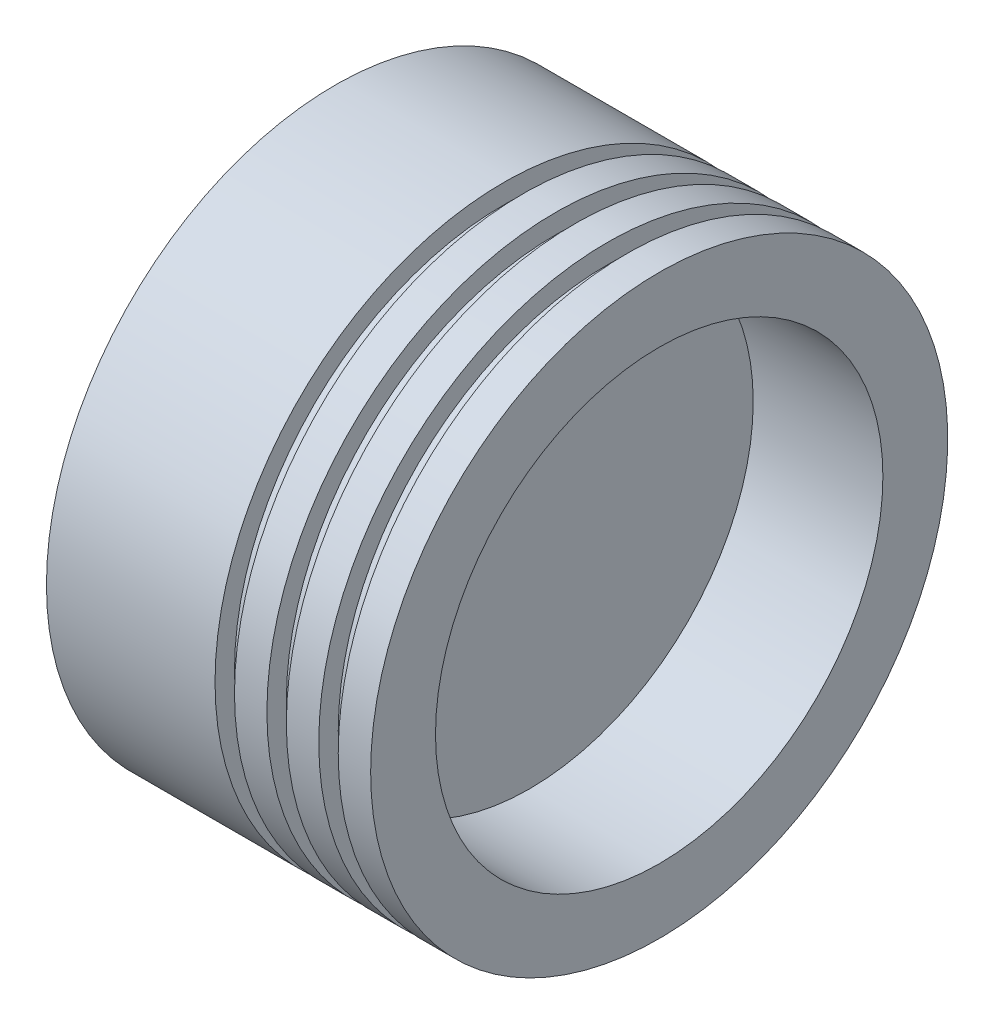
ISO-10303-21;
HEADER;
FILE_DESCRIPTION(('STEP AP214'),'2;1');
FILE_NAME('part.step','',(''),(''),'','','');
FILE_SCHEMA(('AUTOMOTIVE_DESIGN { 1 0 10303 214 1 1 1 1 }'));
ENDSEC;
DATA;
#1=APPLICATION_CONTEXT('core data for automotive mechanical design processes');
#2=APPLICATION_PROTOCOL_DEFINITION('international standard','automotive_design',2000,#1);
#3=PRODUCT_CONTEXT('',#1,'mechanical');
#4=PRODUCT('Part','Part','',(#3));
#5=PRODUCT_RELATED_PRODUCT_CATEGORY('part','',(#4));
#6=PRODUCT_DEFINITION_FORMATION('','',#4);
#7=PRODUCT_DEFINITION_CONTEXT('part definition',#1,'design');
#8=PRODUCT_DEFINITION('design','',#6,#7);
#9=PRODUCT_DEFINITION_SHAPE('','',#8);
#10=(LENGTH_UNIT() NAMED_UNIT(*) SI_UNIT(.MILLI.,.METRE.));
#11=(NAMED_UNIT(*) PLANE_ANGLE_UNIT() SI_UNIT($,.RADIAN.));
#12=(NAMED_UNIT(*) SI_UNIT($,.STERADIAN.) SOLID_ANGLE_UNIT());
#13=UNCERTAINTY_MEASURE_WITH_UNIT(LENGTH_MEASURE(1.E-05),#10,'distance_accuracy_value','');
#14=(GEOMETRIC_REPRESENTATION_CONTEXT(3) GLOBAL_UNCERTAINTY_ASSIGNED_CONTEXT((#13)) GLOBAL_UNIT_ASSIGNED_CONTEXT((#10,
#11,#12)) REPRESENTATION_CONTEXT('',''));
#15=CARTESIAN_POINT('',(0.,0.,0.));
#16=DIRECTION('',(0.,0.,1.));
#17=DIRECTION('',(1.,0.,0.));
#18=AXIS2_PLACEMENT_3D('',#15,#16,#17);
#19=CARTESIAN_POINT('',(0.,0.,0.));
#20=DIRECTION('',(1.,0.,0.));
#21=DIRECTION('',(0.,0.,-1.));
#22=AXIS2_PLACEMENT_3D('',#19,#20,#21);
#23=PLANE('',#22);
#24=CARTESIAN_POINT('',(0.,0.,0.));
#25=DIRECTION('',(-1.,0.,0.));
#26=DIRECTION('',(0.,0.,1.));
#27=AXIS2_PLACEMENT_3D('',#24,#25,#26);
#28=CIRCLE('',#27,44.5);
#29=CARTESIAN_POINT('',(0.,0.,44.5));
#30=VERTEX_POINT('',#29);
#31=EDGE_CURVE('E10',#30,#30,#28,.T.);
#32=ORIENTED_EDGE('',*,*,#31,.T.);
#33=EDGE_LOOP('',(#32));
#34=FACE_BOUND('',#33,.T.);
#35=ADVANCED_FACE('F37',(#34),#23,.F.);
#36=CARTESIAN_POINT('',(0.,0.,0.));
#37=DIRECTION('',(-1.,0.,0.));
#38=DIRECTION('',(0.,0.,1.));
#39=AXIS2_PLACEMENT_3D('',#36,#37,#38);
#40=CYLINDRICAL_SURFACE('',#39,44.5);
#41=ORIENTED_EDGE('',*,*,#31,.F.);
#42=EDGE_LOOP('',(#41));
#43=FACE_BOUND('',#42,.T.);
#44=CARTESIAN_POINT('',(26.,0.,0.));
#45=DIRECTION('',(-1.,0.,0.));
#46=DIRECTION('',(0.,0.,1.));
#47=AXIS2_PLACEMENT_3D('',#44,#45,#46);
#48=CIRCLE('',#47,44.5);
#49=CARTESIAN_POINT('',(26.,0.,44.5));
#50=VERTEX_POINT('',#49);
#51=EDGE_CURVE('E43',#50,#50,#48,.T.);
#52=ORIENTED_EDGE('',*,*,#51,.T.);
#53=EDGE_LOOP('',(#52));
#54=FACE_BOUND('',#53,.T.);
#55=ADVANCED_FACE('F105',(#43,#54),#40,.T.);
#56=CARTESIAN_POINT('',(26.,44.5,0.));
#57=DIRECTION('',(-1.,0.,0.));
#58=DIRECTION('',(0.,0.,1.));
#59=AXIS2_PLACEMENT_3D('',#56,#57,#58);
#60=PLANE('',#59);
#61=ORIENTED_EDGE('',*,*,#51,.F.);
#62=EDGE_LOOP('',(#61));
#63=FACE_BOUND('',#62,.T.);
#64=CARTESIAN_POINT('',(26.,0.,0.));
#65=DIRECTION('',(-1.,0.,0.));
#66=DIRECTION('',(0.,0.,1.));
#67=AXIS2_PLACEMENT_3D('',#64,#65,#66);
#68=CIRCLE('',#67,41.5);
#69=CARTESIAN_POINT('',(26.,0.,41.5));
#70=VERTEX_POINT('',#69);
#71=EDGE_CURVE('E47',#70,#70,#68,.T.);
#72=ORIENTED_EDGE('',*,*,#71,.T.);
#73=EDGE_LOOP('',(#72));
#74=FACE_BOUND('',#73,.T.);
#75=ADVANCED_FACE('F109',(#63,#74),#60,.F.);
#76=CARTESIAN_POINT('',(0.,0.,0.));
#77=DIRECTION('',(-1.,0.,0.));
#78=DIRECTION('',(0.,0.,1.));
#79=AXIS2_PLACEMENT_3D('',#76,#77,#78);
#80=CYLINDRICAL_SURFACE('',#79,41.5);
#81=ORIENTED_EDGE('',*,*,#71,.F.);
#82=EDGE_LOOP('',(#81));
#83=FACE_BOUND('',#82,.T.);
#84=CARTESIAN_POINT('',(29.,0.,0.));
#85=DIRECTION('',(-1.,0.,0.));
#86=DIRECTION('',(0.,0.,1.));
#87=AXIS2_PLACEMENT_3D('',#84,#85,#86);
#88=CIRCLE('',#87,41.5);
#89=CARTESIAN_POINT('',(29.,0.,41.5));
#90=VERTEX_POINT('',#89);
#91=EDGE_CURVE('E51',#90,#90,#88,.T.);
#92=ORIENTED_EDGE('',*,*,#91,.T.);
#93=EDGE_LOOP('',(#92));
#94=FACE_BOUND('',#93,.T.);
#95=ADVANCED_FACE('F114',(#83,#94),#80,.T.);
#96=CARTESIAN_POINT('',(29.,41.5,0.));
#97=DIRECTION('',(1.,0.,0.));
#98=DIRECTION('',(0.,0.,-1.));
#99=AXIS2_PLACEMENT_3D('',#96,#97,#98);
#100=PLANE('',#99);
#101=ORIENTED_EDGE('',*,*,#91,.F.);
#102=EDGE_LOOP('',(#101));
#103=FACE_BOUND('',#102,.T.);
#104=CARTESIAN_POINT('',(29.,0.,0.));
#105=DIRECTION('',(-1.,0.,0.));
#106=DIRECTION('',(0.,0.,1.));
#107=AXIS2_PLACEMENT_3D('',#104,#105,#106);
#108=CIRCLE('',#107,44.5);
#109=CARTESIAN_POINT('',(29.,0.,44.5));
#110=VERTEX_POINT('',#109);
#111=EDGE_CURVE('E56',#110,#110,#108,.T.);
#112=ORIENTED_EDGE('',*,*,#111,.T.);
#113=EDGE_LOOP('',(#112));
#114=FACE_BOUND('',#113,.T.);
#115=ADVANCED_FACE('F120',(#103,#114),#100,.F.);
#116=CARTESIAN_POINT('',(0.,0.,0.));
#117=DIRECTION('',(-1.,0.,0.));
#118=DIRECTION('',(0.,0.,1.));
#119=AXIS2_PLACEMENT_3D('',#116,#117,#118);
#120=CYLINDRICAL_SURFACE('',#119,44.5);
#121=ORIENTED_EDGE('',*,*,#111,.F.);
#122=EDGE_LOOP('',(#121));
#123=FACE_BOUND('',#122,.T.);
#124=CARTESIAN_POINT('',(34.,0.,0.));
#125=DIRECTION('',(-1.,0.,0.));
#126=DIRECTION('',(0.,0.,1.));
#127=AXIS2_PLACEMENT_3D('',#124,#125,#126);
#128=CIRCLE('',#127,44.5);
#129=CARTESIAN_POINT('',(34.,0.,44.5));
#130=VERTEX_POINT('',#129);
#131=EDGE_CURVE('E59',#130,#130,#128,.T.);
#132=ORIENTED_EDGE('',*,*,#131,.T.);
#133=EDGE_LOOP('',(#132));
#134=FACE_BOUND('',#133,.T.);
#135=ADVANCED_FACE('F124',(#123,#134),#120,.T.);
#136=CARTESIAN_POINT('',(34.,44.5,0.));
#137=DIRECTION('',(-1.,0.,0.));
#138=DIRECTION('',(0.,0.,1.));
#139=AXIS2_PLACEMENT_3D('',#136,#137,#138);
#140=PLANE('',#139);
#141=ORIENTED_EDGE('',*,*,#131,.F.);
#142=EDGE_LOOP('',(#141));
#143=FACE_BOUND('',#142,.T.);
#144=CARTESIAN_POINT('',(34.,0.,0.));
#145=DIRECTION('',(-1.,0.,0.));
#146=DIRECTION('',(0.,0.,1.));
#147=AXIS2_PLACEMENT_3D('',#144,#145,#146);
#148=CIRCLE('',#147,41.5);
#149=CARTESIAN_POINT('',(34.,0.,41.5));
#150=VERTEX_POINT('',#149);
#151=EDGE_CURVE('E62',#150,#150,#148,.T.);
#152=ORIENTED_EDGE('',*,*,#151,.T.);
#153=EDGE_LOOP('',(#152));
#154=FACE_BOUND('',#153,.T.);
#155=ADVANCED_FACE('F128',(#143,#154),#140,.F.);
#156=CARTESIAN_POINT('',(0.,0.,0.));
#157=DIRECTION('',(-1.,0.,0.));
#158=DIRECTION('',(0.,0.,1.));
#159=AXIS2_PLACEMENT_3D('',#156,#157,#158);
#160=CYLINDRICAL_SURFACE('',#159,41.5);
#161=ORIENTED_EDGE('',*,*,#151,.F.);
#162=EDGE_LOOP('',(#161));
#163=FACE_BOUND('',#162,.T.);
#164=CARTESIAN_POINT('',(37.,0.,0.));
#165=DIRECTION('',(-1.,0.,0.));
#166=DIRECTION('',(0.,0.,1.));
#167=AXIS2_PLACEMENT_3D('',#164,#165,#166);
#168=CIRCLE('',#167,41.5);
#169=CARTESIAN_POINT('',(37.,0.,41.5));
#170=VERTEX_POINT('',#169);
#171=EDGE_CURVE('E65',#170,#170,#168,.T.);
#172=ORIENTED_EDGE('',*,*,#171,.T.);
#173=EDGE_LOOP('',(#172));
#174=FACE_BOUND('',#173,.T.);
#175=ADVANCED_FACE('F132',(#163,#174),#160,.T.);
#176=CARTESIAN_POINT('',(37.,41.5,0.));
#177=DIRECTION('',(1.,0.,0.));
#178=DIRECTION('',(0.,0.,-1.));
#179=AXIS2_PLACEMENT_3D('',#176,#177,#178);
#180=PLANE('',#179);
#181=ORIENTED_EDGE('',*,*,#171,.F.);
#182=EDGE_LOOP('',(#181));
#183=FACE_BOUND('',#182,.T.);
#184=CARTESIAN_POINT('',(37.,0.,0.));
#185=DIRECTION('',(-1.,0.,0.));
#186=DIRECTION('',(0.,0.,1.));
#187=AXIS2_PLACEMENT_3D('',#184,#185,#186);
#188=CIRCLE('',#187,44.5);
#189=CARTESIAN_POINT('',(37.,0.,44.5));
#190=VERTEX_POINT('',#189);
#191=EDGE_CURVE('E68',#190,#190,#188,.T.);
#192=ORIENTED_EDGE('',*,*,#191,.T.);
#193=EDGE_LOOP('',(#192));
#194=FACE_BOUND('',#193,.T.);
#195=ADVANCED_FACE('F136',(#183,#194),#180,.F.);
#196=CARTESIAN_POINT('',(0.,0.,0.));
#197=DIRECTION('',(-1.,0.,0.));
#198=DIRECTION('',(0.,0.,1.));
#199=AXIS2_PLACEMENT_3D('',#196,#197,#198);
#200=CYLINDRICAL_SURFACE('',#199,44.5);
#201=ORIENTED_EDGE('',*,*,#191,.F.);
#202=EDGE_LOOP('',(#201));
#203=FACE_BOUND('',#202,.T.);
#204=CARTESIAN_POINT('',(42.,0.,0.));
#205=DIRECTION('',(-1.,0.,0.));
#206=DIRECTION('',(0.,0.,1.));
#207=AXIS2_PLACEMENT_3D('',#204,#205,#206);
#208=CIRCLE('',#207,44.5);
#209=CARTESIAN_POINT('',(42.,0.,44.5));
#210=VERTEX_POINT('',#209);
#211=EDGE_CURVE('E71',#210,#210,#208,.T.);
#212=ORIENTED_EDGE('',*,*,#211,.T.);
#213=EDGE_LOOP('',(#212));
#214=FACE_BOUND('',#213,.T.);
#215=ADVANCED_FACE('F140',(#203,#214),#200,.T.);
#216=CARTESIAN_POINT('',(42.,44.5,0.));
#217=DIRECTION('',(-1.,0.,0.));
#218=DIRECTION('',(0.,0.,1.));
#219=AXIS2_PLACEMENT_3D('',#216,#217,#218);
#220=PLANE('',#219);
#221=ORIENTED_EDGE('',*,*,#211,.F.);
#222=EDGE_LOOP('',(#221));
#223=FACE_BOUND('',#222,.T.);
#224=CARTESIAN_POINT('',(42.,0.,0.));
#225=DIRECTION('',(-1.,0.,0.));
#226=DIRECTION('',(0.,0.,1.));
#227=AXIS2_PLACEMENT_3D('',#224,#225,#226);
#228=CIRCLE('',#227,41.5);
#229=CARTESIAN_POINT('',(42.,0.,41.5));
#230=VERTEX_POINT('',#229);
#231=EDGE_CURVE('E74',#230,#230,#228,.T.);
#232=ORIENTED_EDGE('',*,*,#231,.T.);
#233=EDGE_LOOP('',(#232));
#234=FACE_BOUND('',#233,.T.);
#235=ADVANCED_FACE('F144',(#223,#234),#220,.F.);
#236=CARTESIAN_POINT('',(0.,0.,0.));
#237=DIRECTION('',(-1.,0.,0.));
#238=DIRECTION('',(0.,0.,1.));
#239=AXIS2_PLACEMENT_3D('',#236,#237,#238);
#240=CYLINDRICAL_SURFACE('',#239,41.5);
#241=ORIENTED_EDGE('',*,*,#231,.F.);
#242=EDGE_LOOP('',(#241));
#243=FACE_BOUND('',#242,.T.);
#244=CARTESIAN_POINT('',(45.,0.,0.));
#245=DIRECTION('',(-1.,0.,0.));
#246=DIRECTION('',(0.,0.,1.));
#247=AXIS2_PLACEMENT_3D('',#244,#245,#246);
#248=CIRCLE('',#247,41.5);
#249=CARTESIAN_POINT('',(45.,0.,41.5));
#250=VERTEX_POINT('',#249);
#251=EDGE_CURVE('E77',#250,#250,#248,.T.);
#252=ORIENTED_EDGE('',*,*,#251,.T.);
#253=EDGE_LOOP('',(#252));
#254=FACE_BOUND('',#253,.T.);
#255=ADVANCED_FACE('F148',(#243,#254),#240,.T.);
#256=CARTESIAN_POINT('',(45.,41.5,0.));
#257=DIRECTION('',(1.,0.,0.));
#258=DIRECTION('',(0.,0.,-1.));
#259=AXIS2_PLACEMENT_3D('',#256,#257,#258);
#260=PLANE('',#259);
#261=ORIENTED_EDGE('',*,*,#251,.F.);
#262=EDGE_LOOP('',(#261));
#263=FACE_BOUND('',#262,.T.);
#264=CARTESIAN_POINT('',(45.,0.,0.));
#265=DIRECTION('',(-1.,0.,0.));
#266=DIRECTION('',(0.,0.,1.));
#267=AXIS2_PLACEMENT_3D('',#264,#265,#266);
#268=CIRCLE('',#267,44.5);
#269=CARTESIAN_POINT('',(45.,0.,44.5));
#270=VERTEX_POINT('',#269);
#271=EDGE_CURVE('E80',#270,#270,#268,.T.);
#272=ORIENTED_EDGE('',*,*,#271,.T.);
#273=EDGE_LOOP('',(#272));
#274=FACE_BOUND('',#273,.T.);
#275=ADVANCED_FACE('F152',(#263,#274),#260,.F.);
#276=CARTESIAN_POINT('',(0.,0.,0.));
#277=DIRECTION('',(-1.,0.,0.));
#278=DIRECTION('',(0.,0.,1.));
#279=AXIS2_PLACEMENT_3D('',#276,#277,#278);
#280=CYLINDRICAL_SURFACE('',#279,44.5);
#281=ORIENTED_EDGE('',*,*,#271,.F.);
#282=EDGE_LOOP('',(#281));
#283=FACE_BOUND('',#282,.T.);
#284=CARTESIAN_POINT('',(50.,0.,0.));
#285=DIRECTION('',(-1.,0.,0.));
#286=DIRECTION('',(0.,0.,1.));
#287=AXIS2_PLACEMENT_3D('',#284,#285,#286);
#288=CIRCLE('',#287,44.5);
#289=CARTESIAN_POINT('',(50.,0.,44.5));
#290=VERTEX_POINT('',#289);
#291=EDGE_CURVE('E83',#290,#290,#288,.T.);
#292=ORIENTED_EDGE('',*,*,#291,.T.);
#293=EDGE_LOOP('',(#292));
#294=FACE_BOUND('',#293,.T.);
#295=ADVANCED_FACE('F156',(#283,#294),#280,.T.);
#296=CARTESIAN_POINT('',(50.,44.5,0.));
#297=DIRECTION('',(-1.,0.,0.));
#298=DIRECTION('',(0.,0.,1.));
#299=AXIS2_PLACEMENT_3D('',#296,#297,#298);
#300=PLANE('',#299);
#301=ORIENTED_EDGE('',*,*,#291,.F.);
#302=EDGE_LOOP('',(#301));
#303=FACE_BOUND('',#302,.T.);
#304=CARTESIAN_POINT('',(50.,0.,0.));
#305=DIRECTION('',(-1.,0.,0.));
#306=DIRECTION('',(0.,0.,1.));
#307=AXIS2_PLACEMENT_3D('',#304,#305,#306);
#308=CIRCLE('',#307,34.5);
#309=CARTESIAN_POINT('',(50.,0.,34.5));
#310=VERTEX_POINT('',#309);
#311=EDGE_CURVE('E86',#310,#310,#308,.T.);
#312=ORIENTED_EDGE('',*,*,#311,.T.);
#313=EDGE_LOOP('',(#312));
#314=FACE_BOUND('',#313,.T.);
#315=ADVANCED_FACE('F101',(#303,#314),#300,.F.);
#316=CARTESIAN_POINT('',(0.,0.,0.));
#317=DIRECTION('',(-1.,0.,0.));
#318=DIRECTION('',(0.,0.,1.));
#319=AXIS2_PLACEMENT_3D('',#316,#317,#318);
#320=CYLINDRICAL_SURFACE('',#319,34.5);
#321=ORIENTED_EDGE('',*,*,#311,.F.);
#322=EDGE_LOOP('',(#321));
#323=FACE_BOUND('',#322,.T.);
#324=CARTESIAN_POINT('',(30.,0.,0.));
#325=DIRECTION('',(-1.,0.,0.));
#326=DIRECTION('',(0.,0.,1.));
#327=AXIS2_PLACEMENT_3D('',#324,#325,#326);
#328=CIRCLE('',#327,34.5);
#329=CARTESIAN_POINT('',(30.,0.,34.5));
#330=VERTEX_POINT('',#329);
#331=EDGE_CURVE('E89',#330,#330,#328,.T.);
#332=ORIENTED_EDGE('',*,*,#331,.T.);
#333=EDGE_LOOP('',(#332));
#334=FACE_BOUND('',#333,.T.);
#335=ADVANCED_FACE('F93',(#323,#334),#320,.F.);
#336=CARTESIAN_POINT('',(30.,34.5,0.));
#337=DIRECTION('',(-1.,0.,0.));
#338=DIRECTION('',(0.,0.,1.));
#339=AXIS2_PLACEMENT_3D('',#336,#337,#338);
#340=PLANE('',#339);
#341=ORIENTED_EDGE('',*,*,#331,.F.);
#342=EDGE_LOOP('',(#341));
#343=FACE_BOUND('',#342,.T.);
#344=ADVANCED_FACE('F95',(#343),#340,.F.);
#345=CLOSED_SHELL('',(#35,#55,#75,#95,#115,#135,#155,#175,#195,#215,#235,#255,#275,#295,#315,
#335,#344));
#346=MANIFOLD_SOLID_BREP('B2',#345);
#347=ADVANCED_BREP_SHAPE_REPRESENTATION('',(#18,#346),#14);
#348=SHAPE_DEFINITION_REPRESENTATION(#9,#347);
ENDSEC;
END-ISO-10303-21;
